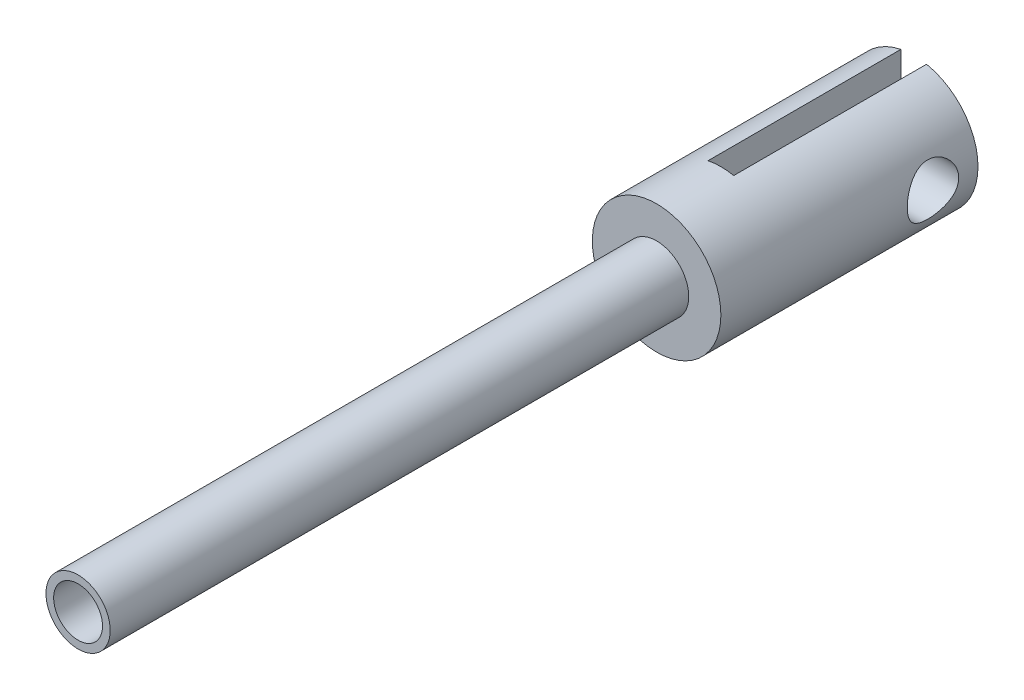
ISO-10303-21;
HEADER;
FILE_DESCRIPTION(('STEP AP214'),'2;1');
FILE_NAME('part.step','',(''),(''),'','','');
FILE_SCHEMA(('AUTOMOTIVE_DESIGN { 1 0 10303 214 1 1 1 1 }'));
ENDSEC;
DATA;
#1=APPLICATION_CONTEXT('core data for automotive mechanical design processes');
#2=APPLICATION_PROTOCOL_DEFINITION('international standard','automotive_design',2000,#1);
#3=PRODUCT_CONTEXT('',#1,'mechanical');
#4=PRODUCT('Part','Part','',(#3));
#5=PRODUCT_RELATED_PRODUCT_CATEGORY('part','',(#4));
#6=PRODUCT_DEFINITION_FORMATION('','',#4);
#7=PRODUCT_DEFINITION_CONTEXT('part definition',#1,'design');
#8=PRODUCT_DEFINITION('design','',#6,#7);
#9=PRODUCT_DEFINITION_SHAPE('','',#8);
#10=(LENGTH_UNIT() NAMED_UNIT(*) SI_UNIT(.MILLI.,.METRE.));
#11=(NAMED_UNIT(*) PLANE_ANGLE_UNIT() SI_UNIT($,.RADIAN.));
#12=(NAMED_UNIT(*) SI_UNIT($,.STERADIAN.) SOLID_ANGLE_UNIT());
#13=UNCERTAINTY_MEASURE_WITH_UNIT(LENGTH_MEASURE(1.E-05),#10,'distance_accuracy_value','');
#14=(GEOMETRIC_REPRESENTATION_CONTEXT(3) GLOBAL_UNCERTAINTY_ASSIGNED_CONTEXT((#13)) GLOBAL_UNIT_ASSIGNED_CONTEXT((#10,
#11,#12)) REPRESENTATION_CONTEXT('',''));
#15=CARTESIAN_POINT('',(0.,0.,0.));
#16=DIRECTION('',(0.,0.,1.));
#17=DIRECTION('',(1.,0.,0.));
#18=AXIS2_PLACEMENT_3D('',#15,#16,#17);
#19=CARTESIAN_POINT('',(0.,0.,40.));
#20=DIRECTION('',(0.,0.,-1.));
#21=DIRECTION('',(-1.,0.,0.));
#22=AXIS2_PLACEMENT_3D('',#19,#20,#21);
#23=CYLINDRICAL_SURFACE('',#22,10.);
#24=CARTESIAN_POINT('',(0.,0.,40.));
#25=DIRECTION('',(0.,0.,1.));
#26=DIRECTION('',(1.,0.,0.));
#27=AXIS2_PLACEMENT_3D('',#24,#25,#26);
#28=CIRCLE('',#27,10.);
#29=CARTESIAN_POINT('',(10.,0.,40.));
#30=VERTEX_POINT('',#29);
#31=EDGE_CURVE('E89',#30,#30,#28,.T.);
#32=ORIENTED_EDGE('',*,*,#31,.F.);
#33=EDGE_LOOP('',(#32));
#34=FACE_BOUND('',#33,.T.);
#35=DIRECTION('',(0.,0.,-1.));
#36=VECTOR('',#35,1.);
#37=CARTESIAN_POINT('',(2.,-9.79795897113271,40.));
#38=LINE('',#37,#36);
#39=CARTESIAN_POINT('',(2.,-9.79795897113272,0.));
#40=VERTEX_POINT('',#39);
#41=CARTESIAN_POINT('',(2.,-9.79795897113272,30.));
#42=VERTEX_POINT('',#41);
#43=EDGE_CURVE('E125',#40,#42,#38,.F.);
#44=ORIENTED_EDGE('',*,*,#43,.F.);
#45=CARTESIAN_POINT('',(0.,0.,0.));
#46=DIRECTION('',(0.,0.,1.));
#47=DIRECTION('',(1.,0.,0.));
#48=AXIS2_PLACEMENT_3D('',#45,#46,#47);
#49=CIRCLE('',#48,10.);
#50=CARTESIAN_POINT('',(2.,9.79795897113271,0.));
#51=VERTEX_POINT('',#50);
#52=EDGE_CURVE('E102',#40,#51,#49,.T.);
#53=ORIENTED_EDGE('',*,*,#52,.T.);
#54=DIRECTION('',(0.,0.,-1.));
#55=VECTOR('',#54,1.);
#56=CARTESIAN_POINT('',(2.,9.79795897113271,40.));
#57=LINE('',#56,#55);
#58=CARTESIAN_POINT('',(2.,9.79795897113271,30.));
#59=VERTEX_POINT('',#58);
#60=EDGE_CURVE('E109',#59,#51,#57,.T.);
#61=ORIENTED_EDGE('',*,*,#60,.F.);
#62=CARTESIAN_POINT('',(0.,0.,30.));
#63=DIRECTION('',(0.,0.,-1.));
#64=DIRECTION('',(-1.,0.,0.));
#65=AXIS2_PLACEMENT_3D('',#62,#63,#64);
#66=CIRCLE('',#65,10.);
#67=CARTESIAN_POINT('',(-2.,9.79795897113271,30.));
#68=VERTEX_POINT('',#67);
#69=EDGE_CURVE('E96',#68,#59,#66,.T.);
#70=ORIENTED_EDGE('',*,*,#69,.F.);
#71=DIRECTION('',(0.,0.,-1.));
#72=VECTOR('',#71,1.);
#73=CARTESIAN_POINT('',(-2.,9.79795897113271,40.));
#74=LINE('',#73,#72);
#75=CARTESIAN_POINT('',(-2.,9.79795897113271,0.));
#76=VERTEX_POINT('',#75);
#77=EDGE_CURVE('E83',#76,#68,#74,.F.);
#78=ORIENTED_EDGE('',*,*,#77,.F.);
#79=CARTESIAN_POINT('',(-2.,-9.79795897113271,0.));
#80=VERTEX_POINT('',#79);
#81=EDGE_CURVE('E94',#76,#80,#49,.T.);
#82=ORIENTED_EDGE('',*,*,#81,.T.);
#83=DIRECTION('',(0.,0.,-1.));
#84=VECTOR('',#83,1.);
#85=CARTESIAN_POINT('',(-2.,-9.79795897113271,40.));
#86=LINE('',#85,#84);
#87=CARTESIAN_POINT('',(-2.,-9.79795897113272,30.));
#88=VERTEX_POINT('',#87);
#89=EDGE_CURVE('E56',#88,#80,#86,.T.);
#90=ORIENTED_EDGE('',*,*,#89,.F.);
#91=EDGE_CURVE('E48',#42,#88,#66,.T.);
#92=ORIENTED_EDGE('',*,*,#91,.F.);
#93=EDGE_LOOP('',(#44,#53,#61,#70,#78,#82,#90,#92));
#94=FACE_BOUND('',#93,.T.);
#95=CARTESIAN_POINT('',(10.,0.,11.));
#96=CARTESIAN_POINT('',(9.99999886871264,-0.107549581345537,10.9999984250671));
#97=CARTESIAN_POINT('',(9.99825999367799,-0.215132147940362,10.9956563289198));
#98=CARTESIAN_POINT('',(9.99134740691108,-0.429535200549549,10.9783266172161));
#99=CARTESIAN_POINT('',(9.98617152790588,-0.536355162703302,10.9653335465974));
#100=CARTESIAN_POINT('',(9.97250573560117,-0.748635856497417,10.9307919654494));
#101=CARTESIAN_POINT('',(9.96400865312144,-0.854093134440869,10.9092249453802));
#102=CARTESIAN_POINT('',(9.94393017211574,-1.0626676111401,10.8577582695632));
#103=CARTESIAN_POINT('',(9.932347522545,-1.1657838422726,10.8278552337447));
#104=CARTESIAN_POINT('',(9.89349112162205,-1.46979509681069,10.726277191284));
#105=CARTESIAN_POINT('',(9.86204458846134,-1.66629107461992,10.6425781809936));
#106=CARTESIAN_POINT('',(9.79113035538708,-2.04217417878102,10.4459537826502));
#107=CARTESIAN_POINT('',(9.75166544086262,-2.22156721456799,10.3330385398851));
#108=CARTESIAN_POINT('',(9.66661825353092,-2.56699339938209,10.0755312454783));
#109=CARTESIAN_POINT('',(9.62084608086599,-2.73212223266508,9.92978728942438));
#110=CARTESIAN_POINT('',(9.52921139577231,-3.03635232313263,9.61319939084796));
#111=CARTESIAN_POINT('',(9.48334885017047,-3.17544084661153,9.44234324098346));
#112=CARTESIAN_POINT('',(9.39445587657958,-3.42974847409894,9.0711440314337));
#113=CARTESIAN_POINT('',(9.35164233015934,-3.54362978572887,8.86982707393626));
#114=CARTESIAN_POINT('',(9.2766729328807,-3.73550961465234,8.44892715719913));
#115=CARTESIAN_POINT('',(9.24451202207146,-3.81352517485723,8.2293529322586));
#116=CARTESIAN_POINT('',(9.19652715590089,-3.92779760260541,7.78857534431419));
#117=CARTESIAN_POINT('',(9.18002840771385,-3.96578791979826,7.56789753191187));
#118=CARTESIAN_POINT('',(9.16328008038142,-4.00434593508728,7.12273000032267));
#119=CARTESIAN_POINT('',(9.16302251073202,-4.00493203570086,6.89824220998889));
#120=CARTESIAN_POINT('',(9.17821000534301,-3.9699787321474,6.46848665777683));
#121=CARTESIAN_POINT('',(9.19256349925666,-3.93695062778272,6.26296857123435));
#122=CARTESIAN_POINT('',(9.23352375055553,-3.83989376129508,5.86068088764966));
#123=CARTESIAN_POINT('',(9.26013264599921,-3.77585958980135,5.66391282369374));
#124=CARTESIAN_POINT('',(9.32318970221162,-3.6173894649114,5.27996432770806));
#125=CARTESIAN_POINT('',(9.35982758573424,-3.52235972457939,5.09306152191752));
#126=CARTESIAN_POINT('',(9.43876232767927,-3.30501292151569,4.73716836724996));
#127=CARTESIAN_POINT('',(9.48106130910412,-3.1826856102159,4.56818478118693));
#128=CARTESIAN_POINT('',(9.57053473488081,-2.90310119889356,4.23918054240404));
#129=CARTESIAN_POINT('',(9.61783329953252,-2.74387492593717,4.08086254111012));
#130=CARTESIAN_POINT('',(9.70919649915615,-2.40062885486449,3.79263104399377));
#131=CARTESIAN_POINT('',(9.75326048890393,-2.21660413066998,3.66272320517883));
#132=CARTESIAN_POINT('',(9.83429362529358,-1.82415530521056,3.43276510516893));
#133=CARTESIAN_POINT('',(9.87110540190899,-1.61532098269266,3.33335543760606));
#134=CARTESIAN_POINT('',(9.93229656657448,-1.18204753096606,3.17166427784373));
#135=CARTESIAN_POINT('',(9.95668226924746,-0.9576163936994,3.10936392488513));
#136=CARTESIAN_POINT('',(9.98912279013839,-0.513791775215592,3.02710340916064));
#137=CARTESIAN_POINT('',(9.99805891667034,-0.294886587971141,3.00485509149294));
#138=CARTESIAN_POINT('',(10.0013695702126,0.143690619615705,2.99657379894272));
#139=CARTESIAN_POINT('',(9.99574787164577,0.363362426448182,3.01053143690481));
#140=CARTESIAN_POINT('',(9.97115134127512,0.786865478243654,3.07258350510414));
#141=CARTESIAN_POINT('',(9.95278782691064,0.990964983549761,3.11911596070253));
#142=CARTESIAN_POINT('',(9.90518882810983,1.38827085612275,3.24287141661905));
#143=CARTESIAN_POINT('',(9.87595194712999,1.58147582045412,3.32009835933521));
#144=CARTESIAN_POINT('',(9.80833189541687,1.95815757162884,3.50556987936211));
#145=CARTESIAN_POINT('',(9.76969631959847,2.14115604549353,3.61469094409467));
#146=CARTESIAN_POINT('',(9.68746729490809,2.4868871825104,3.85988064780291));
#147=CARTESIAN_POINT('',(9.64387186219643,2.64961168158684,3.99596008581391));
#148=CARTESIAN_POINT('',(9.55290235277181,2.96144608598878,4.30174002593264));
#149=CARTESIAN_POINT('',(9.50546882853787,3.10894786734725,4.47306708314085));
#150=CARTESIAN_POINT('',(9.4148334583058,3.37350239509234,4.83888016589028));
#151=CARTESIAN_POINT('',(9.37163231039242,3.4905501236659,5.03337000019944));
#152=CARTESIAN_POINT('',(9.2942859982933,3.69161500286277,5.44292338967332));
#153=CARTESIAN_POINT('',(9.2602326182174,3.77530118531766,5.6581680002435));
#154=CARTESIAN_POINT('',(9.20647346903737,3.90459244315908,6.10146730161278));
#155=CARTESIAN_POINT('',(9.1867571119746,3.95022562452797,6.32951240484181));
#156=CARTESIAN_POINT('',(9.16543518780389,3.99943122157416,6.77425580984401));
#157=CARTESIAN_POINT('',(9.16262842667612,4.00579411777209,6.99058970189503));
#158=CARTESIAN_POINT('',(9.17229671415009,3.98360636538274,7.42108969272114));
#159=CARTESIAN_POINT('',(9.18476982225497,3.9550601501471,7.63525606328247));
#160=CARTESIAN_POINT('',(9.2225330048627,3.86614256488129,8.0466644608903));
#161=CARTESIAN_POINT('',(9.2472967218297,3.80707437387706,8.24424084622109));
#162=CARTESIAN_POINT('',(9.30647993934966,3.66001151041638,8.6267569617897));
#163=CARTESIAN_POINT('',(9.34090210615105,3.5720088493455,8.81169318511131));
#164=CARTESIAN_POINT('',(9.41797252826471,3.36374310804133,9.17522041070949));
#165=CARTESIAN_POINT('',(9.46097893410836,3.24192140926543,9.35284183068834));
#166=CARTESIAN_POINT('',(9.54927479921251,2.97179350239177,9.68598214262481));
#167=CARTESIAN_POINT('',(9.59456494363941,2.82347931168581,9.84149434728997));
#168=CARTESIAN_POINT('',(9.68587647140965,2.49297412446699,10.1364235925306));
#169=CARTESIAN_POINT('',(9.73175488236393,2.30921017071955,10.2741433839823));
#170=CARTESIAN_POINT('',(9.7949502762577,2.01716584575533,10.4560481089375));
#171=CARTESIAN_POINT('',(9.81509269692655,1.91699501972424,10.512607063853));
#172=CARTESIAN_POINT('',(9.85294835133019,1.7118011098248,10.6170379954053));
#173=CARTESIAN_POINT('',(9.87066269647665,1.60678027559742,10.664913949808));
#174=CARTESIAN_POINT('',(9.9028559935491,1.39454646904328,10.750747984685));
#175=CARTESIAN_POINT('',(9.91738778532477,1.28740777135872,10.7888701547472));
#176=CARTESIAN_POINT('',(9.94319722915714,1.06995577523383,10.8559213477213));
#177=CARTESIAN_POINT('',(9.95447639837582,0.959643983352618,10.8848546573499));
#178=CARTESIAN_POINT('',(9.97343330649399,0.736945215856835,10.933174836149));
#179=CARTESIAN_POINT('',(9.98112017494336,0.62456426359128,10.952585911645));
#180=CARTESIAN_POINT('',(9.99270031578293,0.398419132407602,10.9817385706662));
#181=CARTESIAN_POINT('',(9.99659628445551,0.284655994966352,10.9914870268343));
#182=CARTESIAN_POINT('',(9.99951445883957,0.113830463425492,10.9987858955734));
#183=CARTESIAN_POINT('',(10.0000005987258,0.0569198512645293,11.0000008335221));
#184=CARTESIAN_POINT('',(10.,0.,11.));
#185=B_SPLINE_CURVE_WITH_KNOTS('',3,(#95,#96,#97,#98,#99,#100,#101,#102,#103,#104,#105,#106,
#107,#108,#109,#110,#111,#112,#113,#114,#115,#116,#117,#118,#119,#120,#121,#122,#123,#124,#125,
#126,#127,#128,#129,#130,#131,#132,#133,#134,#135,#136,#137,#138,#139,#140,#141,#142,#143,#144,
#145,#146,#147,#148,#149,#150,#151,#152,#153,#154,#155,#156,#157,#158,#159,#160,#161,#162,#163,
#164,#165,#166,#167,#168,#169,#170,#171,#172,#173,#174,#175,#176,#177,#178,#179,#180,#181,#182,
#183,#184),.UNSPECIFIED.,.T.,.F.,(4,2,2,2,2,2,2,2,2,2,2,2,2,2,2,2,2,2,2,2,2,2,2,2,2,2,2,2,2,2,2,
2,2,2,2,2,2,2,2,2,2,2,2,2,4),(0.,0.322603993422155,0.645411604786482,0.968919914471235,
1.29255959093094,1.93701523385824,2.58124739027476,3.25313995292302,3.9253602176033,
4.62749749529941,5.32930078128044,5.99927442509165,6.66891844572484,7.29195888698823,
7.9151080641227,8.55097484497807,9.18708075776541,9.87235930273289,10.5577741757964,
11.2567305822579,11.9553314412776,12.6125760095619,13.2696501904034,13.8972014302891,
14.5248332988777,15.171662586967,15.8187515089811,16.50856181149,17.1984856998767,
17.8950932218183,18.5911857719204,19.2371857868567,19.8831037702627,20.5034786899771,
21.124025035105,21.7801016801356,22.4363763459696,23.1352007896785,23.4851924266232,
23.8350233218042,24.1785111324565,24.52183846562,24.8642884495951,25.2064946871486,
25.3772305569977),.UNSPECIFIED.);
#186=CARTESIAN_POINT('',(10.,0.,11.));
#187=VERTEX_POINT('',#186);
#188=EDGE_CURVE('E164',#187,#187,#185,.T.);
#189=ORIENTED_EDGE('',*,*,#188,.F.);
#190=EDGE_LOOP('',(#189));
#191=FACE_BOUND('',#190,.T.);
#192=CARTESIAN_POINT('',(-10.,0.,11.));
#193=CARTESIAN_POINT('',(-9.99999886871264,0.107549581345536,10.9999984250671));
#194=CARTESIAN_POINT('',(-9.99825999367799,0.215132147940361,10.9956563289198));
#195=CARTESIAN_POINT('',(-9.99134740691108,0.429535200549548,10.9783266172161));
#196=CARTESIAN_POINT('',(-9.98617152790588,0.536355162703301,10.9653335465974));
#197=CARTESIAN_POINT('',(-9.97250573560117,0.748635856497416,10.9307919654494));
#198=CARTESIAN_POINT('',(-9.96400865312144,0.854093134440869,10.9092249453802));
#199=CARTESIAN_POINT('',(-9.94393017211574,1.0626676111401,10.8577582695632));
#200=CARTESIAN_POINT('',(-9.932347522545,1.16578384227259,10.8278552337447));
#201=CARTESIAN_POINT('',(-9.89349112162205,1.46979509681069,10.726277191284));
#202=CARTESIAN_POINT('',(-9.86204458846134,1.66629107461992,10.6425781809936));
#203=CARTESIAN_POINT('',(-9.79113035538708,2.04217417878102,10.4459537826502));
#204=CARTESIAN_POINT('',(-9.75166544086262,2.22156721456798,10.3330385398851));
#205=CARTESIAN_POINT('',(-9.66661825353092,2.56699339938209,10.0755312454783));
#206=CARTESIAN_POINT('',(-9.62084608086599,2.73212223266508,9.92978728942438));
#207=CARTESIAN_POINT('',(-9.52921139577231,3.03635232313263,9.61319939084796));
#208=CARTESIAN_POINT('',(-9.48334885017047,3.17544084661153,9.44234324098346));
#209=CARTESIAN_POINT('',(-9.39445587657958,3.42974847409894,9.0711440314337));
#210=CARTESIAN_POINT('',(-9.35164233015934,3.54362978572887,8.86982707393626));
#211=CARTESIAN_POINT('',(-9.2766729328807,3.73550961465234,8.44892715719913));
#212=CARTESIAN_POINT('',(-9.24451202207146,3.81352517485723,8.2293529322586));
#213=CARTESIAN_POINT('',(-9.19652715590089,3.92779760260541,7.7885753443142));
#214=CARTESIAN_POINT('',(-9.18002840771385,3.96578791979826,7.56789753191188));
#215=CARTESIAN_POINT('',(-9.16328008038143,4.00434593508728,7.12273000032267));
#216=CARTESIAN_POINT('',(-9.16302251073203,4.00493203570086,6.89824220998889));
#217=CARTESIAN_POINT('',(-9.17821000534301,3.9699787321474,6.46848665777683));
#218=CARTESIAN_POINT('',(-9.19256349925666,3.93695062778272,6.26296857123435));
#219=CARTESIAN_POINT('',(-9.23352375055553,3.83989376129508,5.86068088764966));
#220=CARTESIAN_POINT('',(-9.26013264599921,3.77585958980135,5.66391282369374));
#221=CARTESIAN_POINT('',(-9.32318970221162,3.6173894649114,5.27996432770806));
#222=CARTESIAN_POINT('',(-9.35982758573424,3.52235972457939,5.09306152191752));
#223=CARTESIAN_POINT('',(-9.43876232767927,3.30501292151569,4.73716836724996));
#224=CARTESIAN_POINT('',(-9.48106130910412,3.18268561021589,4.56818478118693));
#225=CARTESIAN_POINT('',(-9.57053473488081,2.90310119889356,4.23918054240404));
#226=CARTESIAN_POINT('',(-9.61783329953252,2.74387492593716,4.08086254111012));
#227=CARTESIAN_POINT('',(-9.70919649915615,2.40062885486449,3.79263104399377));
#228=CARTESIAN_POINT('',(-9.75326048890393,2.21660413066997,3.66272320517883));
#229=CARTESIAN_POINT('',(-9.83429362529359,1.82415530521055,3.43276510516893));
#230=CARTESIAN_POINT('',(-9.87110540190899,1.61532098269266,3.33335543760606));
#231=CARTESIAN_POINT('',(-9.93229656657448,1.18204753096606,3.17166427784373));
#232=CARTESIAN_POINT('',(-9.95668226924746,0.957616393699398,3.10936392488513));
#233=CARTESIAN_POINT('',(-9.98912279013839,0.513791775215589,3.02710340916064));
#234=CARTESIAN_POINT('',(-9.99805891667034,0.294886587971139,3.00485509149294));
#235=CARTESIAN_POINT('',(-10.0013695702126,-0.143690619615708,2.99657379894272));
#236=CARTESIAN_POINT('',(-9.99574787164577,-0.363362426448185,3.01053143690481));
#237=CARTESIAN_POINT('',(-9.97115134127512,-0.786865478243656,3.07258350510414));
#238=CARTESIAN_POINT('',(-9.95278782691064,-0.990964983549763,3.11911596070253));
#239=CARTESIAN_POINT('',(-9.90518882810983,-1.38827085612275,3.24287141661905));
#240=CARTESIAN_POINT('',(-9.87595194712999,-1.58147582045412,3.32009835933521));
#241=CARTESIAN_POINT('',(-9.80833189541687,-1.95815757162884,3.50556987936211));
#242=CARTESIAN_POINT('',(-9.76969631959847,-2.14115604549353,3.61469094409467));
#243=CARTESIAN_POINT('',(-9.68746729490809,-2.4868871825104,3.85988064780291));
#244=CARTESIAN_POINT('',(-9.64387186219643,-2.64961168158685,3.99596008581391));
#245=CARTESIAN_POINT('',(-9.55290235277181,-2.96144608598878,4.30174002593264));
#246=CARTESIAN_POINT('',(-9.50546882853787,-3.10894786734725,4.47306708314085));
#247=CARTESIAN_POINT('',(-9.4148334583058,-3.37350239509234,4.83888016589028));
#248=CARTESIAN_POINT('',(-9.37163231039242,-3.4905501236659,5.03337000019944));
#249=CARTESIAN_POINT('',(-9.2942859982933,-3.69161500286277,5.44292338967332));
#250=CARTESIAN_POINT('',(-9.2602326182174,-3.77530118531766,5.6581680002435));
#251=CARTESIAN_POINT('',(-9.20647346903736,-3.90459244315908,6.10146730161278));
#252=CARTESIAN_POINT('',(-9.18675711197461,-3.95022562452798,6.32951240484181));
#253=CARTESIAN_POINT('',(-9.16543518780389,-3.99943122157417,6.77425580984401));
#254=CARTESIAN_POINT('',(-9.16262842667612,-4.0057941177721,6.99058970189503));
#255=CARTESIAN_POINT('',(-9.17229671415009,-3.98360636538274,7.42108969272114));
#256=CARTESIAN_POINT('',(-9.18476982225497,-3.9550601501471,7.63525606328247));
#257=CARTESIAN_POINT('',(-9.2225330048627,-3.86614256488129,8.0466644608903));
#258=CARTESIAN_POINT('',(-9.2472967218297,-3.80707437387706,8.24424084622109));
#259=CARTESIAN_POINT('',(-9.30647993934966,-3.66001151041638,8.6267569617897));
#260=CARTESIAN_POINT('',(-9.34090210615105,-3.5720088493455,8.81169318511131));
#261=CARTESIAN_POINT('',(-9.41797252826471,-3.36374310804133,9.17522041070949));
#262=CARTESIAN_POINT('',(-9.46097893410836,-3.24192140926543,9.35284183068834));
#263=CARTESIAN_POINT('',(-9.54927479921251,-2.97179350239177,9.68598214262481));
#264=CARTESIAN_POINT('',(-9.59456494363941,-2.82347931168581,9.84149434728997));
#265=CARTESIAN_POINT('',(-9.68587647140964,-2.492974124467,10.1364235925306));
#266=CARTESIAN_POINT('',(-9.73175488236393,-2.30921017071955,10.2741433839823));
#267=CARTESIAN_POINT('',(-9.7949502762577,-2.01716584575533,10.4560481089375));
#268=CARTESIAN_POINT('',(-9.81509269692655,-1.91699501972425,10.512607063853));
#269=CARTESIAN_POINT('',(-9.85294835133019,-1.7118011098248,10.6170379954053));
#270=CARTESIAN_POINT('',(-9.87066269647665,-1.60678027559742,10.664913949808));
#271=CARTESIAN_POINT('',(-9.9028559935491,-1.39454646904328,10.750747984685));
#272=CARTESIAN_POINT('',(-9.91738778532477,-1.28740777135871,10.7888701547472));
#273=CARTESIAN_POINT('',(-9.94319722915714,-1.06995577523383,10.8559213477213));
#274=CARTESIAN_POINT('',(-9.95447639837582,-0.959643983352615,10.8848546573499));
#275=CARTESIAN_POINT('',(-9.97343330649399,-0.736945215856833,10.933174836149));
#276=CARTESIAN_POINT('',(-9.98112017494336,-0.624564263591278,10.952585911645));
#277=CARTESIAN_POINT('',(-9.99270031578293,-0.398419132407602,10.9817385706662));
#278=CARTESIAN_POINT('',(-9.99659628445551,-0.284655994966352,10.9914870268343));
#279=CARTESIAN_POINT('',(-9.99951445883957,-0.113830463425492,10.9987858955734));
#280=CARTESIAN_POINT('',(-10.0000005987258,-0.0569198512645299,11.0000008335221));
#281=CARTESIAN_POINT('',(-10.,0.,11.));
#282=B_SPLINE_CURVE_WITH_KNOTS('',3,(#192,#193,#194,#195,#196,#197,#198,#199,#200,#201,#202,
#203,#204,#205,#206,#207,#208,#209,#210,#211,#212,#213,#214,#215,#216,#217,#218,#219,#220,#221,
#222,#223,#224,#225,#226,#227,#228,#229,#230,#231,#232,#233,#234,#235,#236,#237,#238,#239,#240,
#241,#242,#243,#244,#245,#246,#247,#248,#249,#250,#251,#252,#253,#254,#255,#256,#257,#258,#259,
#260,#261,#262,#263,#264,#265,#266,#267,#268,#269,#270,#271,#272,#273,#274,#275,#276,#277,#278,
#279,#280,#281),.UNSPECIFIED.,.T.,.F.,(4,2,2,2,2,2,2,2,2,2,2,2,2,2,2,2,2,2,2,2,2,2,2,2,2,2,2,2,
2,2,2,2,2,2,2,2,2,2,2,2,2,2,2,2,4),(0.,0.322603993422155,0.645411604786482,0.968919914471235,
1.29255959093094,1.93701523385824,2.58124739027476,3.25313995292302,3.9253602176033,
4.62749749529941,5.32930078128043,5.99927442509165,6.66891844572483,7.29195888698823,
7.9151080641227,8.55097484497807,9.18708075776541,9.87235930273289,10.5577741757964,
11.2567305822579,11.9553314412776,12.6125760095619,13.2696501904034,13.8972014302891,
14.5248332988777,15.171662586967,15.8187515089811,16.50856181149,17.1984856998767,
17.8950932218183,18.5911857719204,19.2371857868567,19.8831037702627,20.5034786899771,
21.124025035105,21.7801016801356,22.4363763459696,23.1352007896785,23.4851924266232,
23.8350233218042,24.1785111324565,24.52183846562,24.8642884495951,25.2064946871486,
25.3772305569977),.UNSPECIFIED.);
#283=CARTESIAN_POINT('',(-10.,0.,11.));
#284=VERTEX_POINT('',#283);
#285=EDGE_CURVE('E122',#284,#284,#282,.T.);
#286=ORIENTED_EDGE('',*,*,#285,.F.);
#287=EDGE_LOOP('',(#286));
#288=FACE_BOUND('',#287,.T.);
#289=ADVANCED_FACE('F38',(#34,#94,#191,#288),#23,.T.);
#290=CARTESIAN_POINT('',(0.,0.,0.));
#291=DIRECTION('',(0.,0.,1.));
#292=DIRECTION('',(1.,0.,0.));
#293=AXIS2_PLACEMENT_3D('',#290,#291,#292);
#294=PLANE('',#293);
#295=DIRECTION('',(0.,-1.,0.));
#296=VECTOR('',#295,1.);
#297=CARTESIAN_POINT('',(2.,0.,0.));
#298=LINE('',#297,#296);
#299=EDGE_CURVE('E64',#51,#40,#298,.T.);
#300=ORIENTED_EDGE('',*,*,#299,.F.);
#301=ORIENTED_EDGE('',*,*,#52,.F.);
#302=EDGE_LOOP('',(#300,#301));
#303=FACE_BOUND('',#302,.T.);
#304=ADVANCED_FACE('F134',(#303),#294,.F.);
#305=DIRECTION('',(0.,1.,0.));
#306=VECTOR('',#305,1.);
#307=CARTESIAN_POINT('',(-2.,0.,0.));
#308=LINE('',#307,#306);
#309=EDGE_CURVE('E80',#80,#76,#308,.T.);
#310=ORIENTED_EDGE('',*,*,#309,.F.);
#311=ORIENTED_EDGE('',*,*,#81,.F.);
#312=EDGE_LOOP('',(#310,#311));
#313=FACE_BOUND('',#312,.T.);
#314=ADVANCED_FACE('F100',(#313),#294,.F.);
#315=CARTESIAN_POINT('',(0.,0.,40.));
#316=DIRECTION('',(0.,0.,1.));
#317=DIRECTION('',(1.,0.,0.));
#318=AXIS2_PLACEMENT_3D('',#315,#316,#317);
#319=PLANE('',#318);
#320=CARTESIAN_POINT('',(0.,0.,40.));
#321=DIRECTION('',(0.,0.,1.));
#322=DIRECTION('',(1.,0.,0.));
#323=AXIS2_PLACEMENT_3D('',#320,#321,#322);
#324=CIRCLE('',#323,5.);
#325=CARTESIAN_POINT('',(5.,0.,40.));
#326=VERTEX_POINT('',#325);
#327=EDGE_CURVE('E11',#326,#326,#324,.T.);
#328=ORIENTED_EDGE('',*,*,#327,.F.);
#329=EDGE_LOOP('',(#328));
#330=FACE_BOUND('',#329,.T.);
#331=ORIENTED_EDGE('',*,*,#31,.T.);
#332=EDGE_LOOP('',(#331));
#333=FACE_BOUND('',#332,.T.);
#334=ADVANCED_FACE('F140',(#330,#333),#319,.T.);
#335=CARTESIAN_POINT('',(-2.,20.,30.));
#336=DIRECTION('',(0.,0.,-1.));
#337=DIRECTION('',(-1.,0.,0.));
#338=AXIS2_PLACEMENT_3D('',#335,#336,#337);
#339=PLANE('',#338);
#340=ORIENTED_EDGE('',*,*,#69,.T.);
#341=DIRECTION('',(0.,-1.,0.));
#342=VECTOR('',#341,1.);
#343=CARTESIAN_POINT('',(2.,20.,30.));
#344=LINE('',#343,#342);
#345=EDGE_CURVE('E98',#59,#42,#344,.T.);
#346=ORIENTED_EDGE('',*,*,#345,.T.);
#347=ORIENTED_EDGE('',*,*,#91,.T.);
#348=DIRECTION('',(0.,-1.,0.));
#349=VECTOR('',#348,1.);
#350=CARTESIAN_POINT('',(-2.,20.,30.));
#351=LINE('',#350,#349);
#352=EDGE_CURVE('E120',#68,#88,#351,.T.);
#353=ORIENTED_EDGE('',*,*,#352,.F.);
#354=EDGE_LOOP('',(#340,#346,#347,#353));
#355=FACE_BOUND('',#354,.T.);
#356=ADVANCED_FACE('F119',(#355),#339,.T.);
#357=CARTESIAN_POINT('',(2.,20.,30.));
#358=DIRECTION('',(-1.,0.,0.));
#359=DIRECTION('',(0.,0.,1.));
#360=AXIS2_PLACEMENT_3D('',#357,#358,#359);
#361=PLANE('',#360);
#362=CARTESIAN_POINT('',(2.,0.,7.));
#363=DIRECTION('',(-1.,0.,0.));
#364=DIRECTION('',(0.,0.,1.));
#365=AXIS2_PLACEMENT_3D('',#362,#363,#364);
#366=CIRCLE('',#365,4.);
#367=CARTESIAN_POINT('',(2.,0.,11.));
#368=VERTEX_POINT('',#367);
#369=EDGE_CURVE('E179',#368,#368,#366,.F.);
#370=ORIENTED_EDGE('',*,*,#369,.T.);
#371=EDGE_LOOP('',(#370));
#372=FACE_BOUND('',#371,.T.);
#373=ORIENTED_EDGE('',*,*,#60,.T.);
#374=ORIENTED_EDGE('',*,*,#299,.T.);
#375=ORIENTED_EDGE('',*,*,#43,.T.);
#376=ORIENTED_EDGE('',*,*,#345,.F.);
#377=EDGE_LOOP('',(#373,#374,#375,#376));
#378=FACE_BOUND('',#377,.T.);
#379=ADVANCED_FACE('F131',(#372,#378),#361,.T.);
#380=CARTESIAN_POINT('',(-2.,20.,0.));
#381=DIRECTION('',(1.,0.,0.));
#382=DIRECTION('',(0.,0.,-1.));
#383=AXIS2_PLACEMENT_3D('',#380,#381,#382);
#384=PLANE('',#383);
#385=CARTESIAN_POINT('',(-2.,0.,7.));
#386=DIRECTION('',(1.,0.,0.));
#387=DIRECTION('',(0.,0.,-1.));
#388=AXIS2_PLACEMENT_3D('',#385,#386,#387);
#389=CIRCLE('',#388,4.);
#390=CARTESIAN_POINT('',(-2.,0.,3.));
#391=VERTEX_POINT('',#390);
#392=EDGE_CURVE('E42',#391,#391,#389,.F.);
#393=ORIENTED_EDGE('',*,*,#392,.T.);
#394=EDGE_LOOP('',(#393));
#395=FACE_BOUND('',#394,.T.);
#396=ORIENTED_EDGE('',*,*,#89,.T.);
#397=ORIENTED_EDGE('',*,*,#309,.T.);
#398=ORIENTED_EDGE('',*,*,#77,.T.);
#399=ORIENTED_EDGE('',*,*,#352,.T.);
#400=EDGE_LOOP('',(#396,#397,#398,#399));
#401=FACE_BOUND('',#400,.T.);
#402=ADVANCED_FACE('F82',(#395,#401),#384,.T.);
#403=CARTESIAN_POINT('',(20.,0.,7.));
#404=DIRECTION('',(-1.,0.,0.));
#405=DIRECTION('',(0.,0.,1.));
#406=AXIS2_PLACEMENT_3D('',#403,#404,#405);
#407=CYLINDRICAL_SURFACE('',#406,4.);
#408=ORIENTED_EDGE('',*,*,#392,.F.);
#409=EDGE_LOOP('',(#408));
#410=FACE_BOUND('',#409,.T.);
#411=ORIENTED_EDGE('',*,*,#285,.T.);
#412=EDGE_LOOP('',(#411));
#413=FACE_BOUND('',#412,.T.);
#414=ADVANCED_FACE('F153',(#410,#413),#407,.F.);
#415=ORIENTED_EDGE('',*,*,#369,.F.);
#416=EDGE_LOOP('',(#415));
#417=FACE_BOUND('',#416,.T.);
#418=ORIENTED_EDGE('',*,*,#188,.T.);
#419=EDGE_LOOP('',(#418));
#420=FACE_BOUND('',#419,.T.);
#421=ADVANCED_FACE('F158',(#417,#420),#407,.F.);
#422=CARTESIAN_POINT('',(0.,0.,130.));
#423=DIRECTION('',(0.,0.,-1.));
#424=DIRECTION('',(-1.,0.,0.));
#425=AXIS2_PLACEMENT_3D('',#422,#423,#424);
#426=CYLINDRICAL_SURFACE('',#425,5.);
#427=CARTESIAN_POINT('',(0.,0.,130.));
#428=DIRECTION('',(0.,0.,1.));
#429=DIRECTION('',(1.,0.,0.));
#430=AXIS2_PLACEMENT_3D('',#427,#428,#429);
#431=CIRCLE('',#430,5.);
#432=CARTESIAN_POINT('',(5.,0.,130.));
#433=VERTEX_POINT('',#432);
#434=EDGE_CURVE('E184',#433,#433,#431,.T.);
#435=ORIENTED_EDGE('',*,*,#434,.F.);
#436=EDGE_LOOP('',(#435));
#437=FACE_BOUND('',#436,.T.);
#438=ORIENTED_EDGE('',*,*,#327,.T.);
#439=EDGE_LOOP('',(#438));
#440=FACE_BOUND('',#439,.T.);
#441=ADVANCED_FACE('F160',(#437,#440),#426,.T.);
#442=CARTESIAN_POINT('',(0.,0.,130.));
#443=DIRECTION('',(0.,0.,1.));
#444=DIRECTION('',(1.,0.,0.));
#445=AXIS2_PLACEMENT_3D('',#442,#443,#444);
#446=PLANE('',#445);
#447=CARTESIAN_POINT('',(0.,0.,130.));
#448=DIRECTION('',(0.,0.,1.));
#449=DIRECTION('',(1.,0.,0.));
#450=AXIS2_PLACEMENT_3D('',#447,#448,#449);
#451=CIRCLE('',#450,3.8);
#452=CARTESIAN_POINT('',(3.8,0.,130.));
#453=VERTEX_POINT('',#452);
#454=EDGE_CURVE('E191',#453,#453,#451,.T.);
#455=ORIENTED_EDGE('',*,*,#454,.F.);
#456=EDGE_LOOP('',(#455));
#457=FACE_BOUND('',#456,.T.);
#458=ORIENTED_EDGE('',*,*,#434,.T.);
#459=EDGE_LOOP('',(#458));
#460=FACE_BOUND('',#459,.T.);
#461=ADVANCED_FACE('F199',(#457,#460),#446,.T.);
#462=CARTESIAN_POINT('',(0.,0.,110.));
#463=DIRECTION('',(0.,0.,1.));
#464=DIRECTION('',(1.,0.,0.));
#465=AXIS2_PLACEMENT_3D('',#462,#463,#464);
#466=CYLINDRICAL_SURFACE('',#465,3.8);
#467=CARTESIAN_POINT('',(0.,0.,110.));
#468=DIRECTION('',(0.,0.,1.));
#469=DIRECTION('',(1.,0.,0.));
#470=AXIS2_PLACEMENT_3D('',#467,#468,#469);
#471=CIRCLE('',#470,3.8);
#472=CARTESIAN_POINT('',(3.8,0.,110.));
#473=VERTEX_POINT('',#472);
#474=EDGE_CURVE('E187',#473,#473,#471,.T.);
#475=ORIENTED_EDGE('',*,*,#474,.F.);
#476=EDGE_LOOP('',(#475));
#477=FACE_BOUND('',#476,.T.);
#478=ORIENTED_EDGE('',*,*,#454,.T.);
#479=EDGE_LOOP('',(#478));
#480=FACE_BOUND('',#479,.T.);
#481=ADVANCED_FACE('F197',(#477,#480),#466,.F.);
#482=CARTESIAN_POINT('',(0.,0.,110.));
#483=DIRECTION('',(0.,0.,1.));
#484=DIRECTION('',(1.,0.,0.));
#485=AXIS2_PLACEMENT_3D('',#482,#483,#484);
#486=PLANE('',#485);
#487=ORIENTED_EDGE('',*,*,#474,.T.);
#488=EDGE_LOOP('',(#487));
#489=FACE_BOUND('',#488,.T.);
#490=ADVANCED_FACE('F283',(#489),#486,.T.);
#491=CLOSED_SHELL('',(#289,#304,#314,#334,#356,#379,#402,#414,#421,#441,#461,#481,#490));
#492=MANIFOLD_SOLID_BREP('B2',#491);
#493=ADVANCED_BREP_SHAPE_REPRESENTATION('',(#18,#492),#14);
#494=SHAPE_DEFINITION_REPRESENTATION(#9,#493);
ENDSEC;
END-ISO-10303-21;
